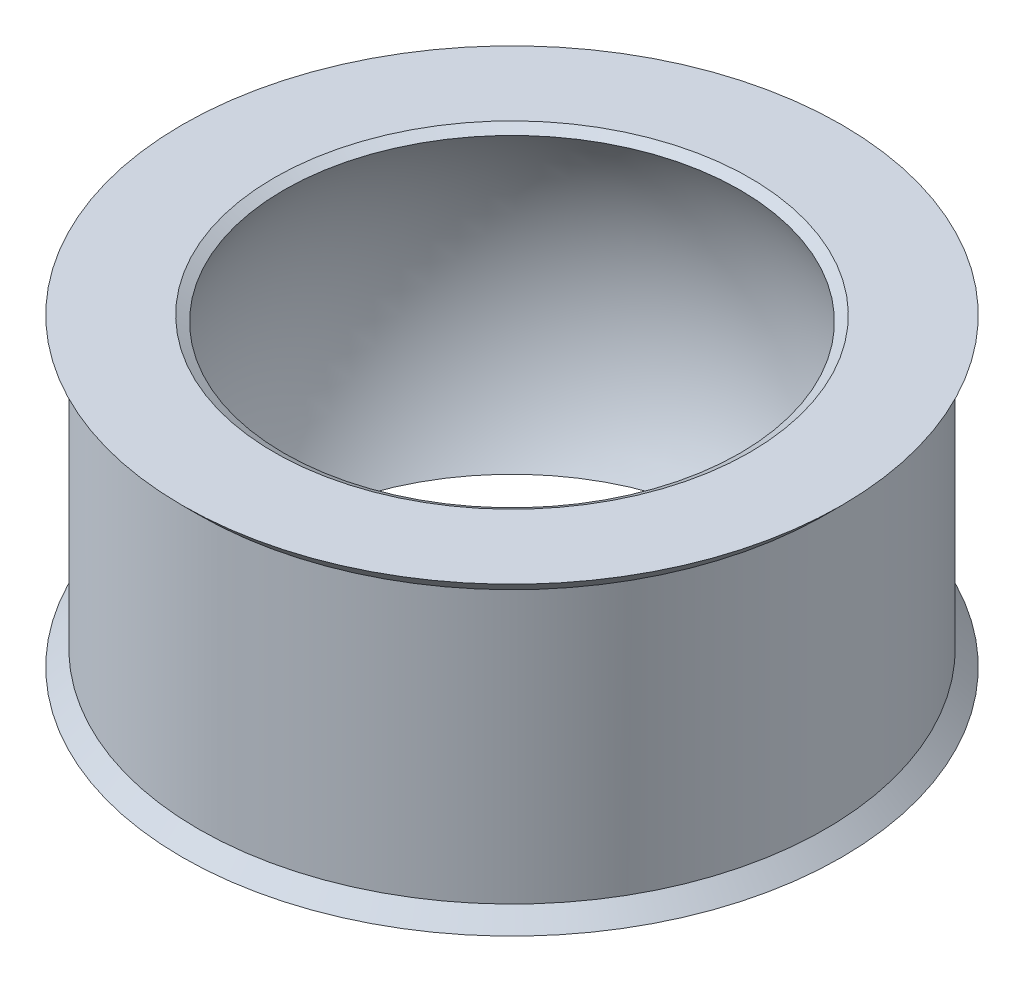
ISO-10303-21;
HEADER;
FILE_DESCRIPTION(('STEP AP214'),'2;1');
FILE_NAME('part.step','',(''),(''),'','','');
FILE_SCHEMA(('AUTOMOTIVE_DESIGN { 1 0 10303 214 1 1 1 1 }'));
ENDSEC;
DATA;
#1=APPLICATION_CONTEXT('core data for automotive mechanical design processes');
#2=APPLICATION_PROTOCOL_DEFINITION('international standard','automotive_design',2000,#1);
#3=PRODUCT_CONTEXT('',#1,'mechanical');
#4=PRODUCT('Part','Part','',(#3));
#5=PRODUCT_RELATED_PRODUCT_CATEGORY('part','',(#4));
#6=PRODUCT_DEFINITION_FORMATION('','',#4);
#7=PRODUCT_DEFINITION_CONTEXT('part definition',#1,'design');
#8=PRODUCT_DEFINITION('design','',#6,#7);
#9=PRODUCT_DEFINITION_SHAPE('','',#8);
#10=(LENGTH_UNIT() NAMED_UNIT(*) SI_UNIT(.MILLI.,.METRE.));
#11=(NAMED_UNIT(*) PLANE_ANGLE_UNIT() SI_UNIT($,.RADIAN.));
#12=(NAMED_UNIT(*) SI_UNIT($,.STERADIAN.) SOLID_ANGLE_UNIT());
#13=UNCERTAINTY_MEASURE_WITH_UNIT(LENGTH_MEASURE(1.E-05),#10,'distance_accuracy_value','');
#14=(GEOMETRIC_REPRESENTATION_CONTEXT(3) GLOBAL_UNCERTAINTY_ASSIGNED_CONTEXT((#13)) GLOBAL_UNIT_ASSIGNED_CONTEXT((#10,
#11,#12)) REPRESENTATION_CONTEXT('',''));
#15=CARTESIAN_POINT('',(0.,0.,0.));
#16=DIRECTION('',(0.,0.,1.));
#17=DIRECTION('',(1.,0.,0.));
#18=AXIS2_PLACEMENT_3D('',#15,#16,#17);
#19=CARTESIAN_POINT('',(0.,0.,39.6748));
#20=DIRECTION('',(0.,-1.,0.));
#21=DIRECTION('',(0.,0.,-1.));
#22=AXIS2_PLACEMENT_3D('',#19,#20,#21);
#23=DEGENERATE_TOROIDAL_SURFACE('',#22,0.00761999999998673,6.34369865976809,.T.);
#24=CARTESIAN_POINT('',(0.,-3.43613254301545,39.6748));
#25=DIRECTION('',(0.,-1.,0.));
#26=DIRECTION('',(1.,0.,0.));
#27=AXIS2_PLACEMENT_3D('',#24,#25,#26);
#28=CIRCLE('',#27,5.34011527264511);
#29=CARTESIAN_POINT('',(5.34011527264511,-3.43613254301545,39.6748));
#30=VERTEX_POINT('',#29);
#31=EDGE_CURVE('E32',#30,#30,#28,.T.);
#32=ORIENTED_EDGE('',*,*,#31,.T.);
#33=EDGE_LOOP('',(#32));
#34=FACE_BOUND('',#33,.T.);
#35=CARTESIAN_POINT('',(0.,3.43613254301545,39.6748));
#36=DIRECTION('',(0.,1.,0.));
#37=DIRECTION('',(1.,0.,0.));
#38=AXIS2_PLACEMENT_3D('',#35,#36,#37);
#39=CIRCLE('',#38,5.34011527258826);
#40=CARTESIAN_POINT('',(5.34011527258826,3.43613254301545,39.6748));
#41=VERTEX_POINT('',#40);
#42=EDGE_CURVE('E29',#41,#41,#39,.T.);
#43=ORIENTED_EDGE('',*,*,#42,.T.);
#44=EDGE_LOOP('',(#43));
#45=FACE_BOUND('',#44,.T.);
#46=ADVANCED_FACE('F14',(#34,#45),#23,.F.);
#47=CARTESIAN_POINT('',(0.,-3.56869999995979,39.6748));
#48=DIRECTION('',(0.,-1.,0.));
#49=DIRECTION('',(1.,0.,0.));
#50=AXIS2_PLACEMENT_3D('',#47,#48,#49);
#51=CONICAL_SURFACE('',#50,5.56982142103379,1.047372084121);
#52=ORIENTED_EDGE('',*,*,#31,.F.);
#53=EDGE_LOOP('',(#52));
#54=FACE_BOUND('',#53,.T.);
#55=CARTESIAN_POINT('',(0.,-3.56869999995979,39.6748));
#56=DIRECTION('',(0.,-1.,0.));
#57=DIRECTION('',(1.,0.,0.));
#58=AXIS2_PLACEMENT_3D('',#55,#56,#57);
#59=CIRCLE('',#58,5.56982142103379);
#60=CARTESIAN_POINT('',(5.56982142103379,-3.56869999995979,39.6748));
#61=VERTEX_POINT('',#60);
#62=EDGE_CURVE('E17',#61,#61,#59,.F.);
#63=ORIENTED_EDGE('',*,*,#62,.F.);
#64=EDGE_LOOP('',(#63));
#65=FACE_BOUND('',#64,.T.);
#66=ADVANCED_FACE('F48',(#54,#65),#51,.F.);
#67=CARTESIAN_POINT('',(0.,3.56869999995979,39.6748));
#68=DIRECTION('',(0.,1.,0.));
#69=DIRECTION('',(-1.,0.,0.));
#70=AXIS2_PLACEMENT_3D('',#67,#68,#69);
#71=CONICAL_SURFACE('',#70,5.56982142103379,1.04737208422814);
#72=CARTESIAN_POINT('',(0.,3.56869999995979,39.6748));
#73=DIRECTION('',(0.,1.,0.));
#74=DIRECTION('',(-1.,0.,0.));
#75=AXIS2_PLACEMENT_3D('',#72,#73,#74);
#76=CIRCLE('',#75,5.56982142103379);
#77=CARTESIAN_POINT('',(-5.56982142103379,3.56869999995979,39.6748));
#78=VERTEX_POINT('',#77);
#79=EDGE_CURVE('E39',#78,#78,#76,.F.);
#80=ORIENTED_EDGE('',*,*,#79,.F.);
#81=EDGE_LOOP('',(#80));
#82=FACE_BOUND('',#81,.T.);
#83=ORIENTED_EDGE('',*,*,#42,.F.);
#84=EDGE_LOOP('',(#83));
#85=FACE_BOUND('',#84,.T.);
#86=ADVANCED_FACE('F50',(#82,#85),#71,.F.);
#87=CARTESIAN_POINT('',(0.,-3.5687,39.6748));
#88=DIRECTION('',(0.,-1.,0.));
#89=DIRECTION('',(0.,0.,-1.));
#90=AXIS2_PLACEMENT_3D('',#87,#88,#89);
#91=PLANE('',#90);
#92=CARTESIAN_POINT('',(0.,-3.5687,39.6748));
#93=DIRECTION('',(0.,-1.,0.));
#94=DIRECTION('',(0.,0.,-1.));
#95=AXIS2_PLACEMENT_3D('',#92,#93,#94);
#96=CIRCLE('',#95,7.7216);
#97=CARTESIAN_POINT('',(0.,-3.5687,31.9532));
#98=VERTEX_POINT('',#97);
#99=EDGE_CURVE('E37',#98,#98,#96,.F.);
#100=ORIENTED_EDGE('',*,*,#99,.F.);
#101=EDGE_LOOP('',(#100));
#102=FACE_BOUND('',#101,.T.);
#103=ORIENTED_EDGE('',*,*,#62,.T.);
#104=EDGE_LOOP('',(#103));
#105=FACE_BOUND('',#104,.T.);
#106=ADVANCED_FACE('F46',(#102,#105),#91,.T.);
#107=CARTESIAN_POINT('',(0.,3.5687,39.6748));
#108=DIRECTION('',(0.,1.,0.));
#109=DIRECTION('',(0.,0.,1.));
#110=AXIS2_PLACEMENT_3D('',#107,#108,#109);
#111=PLANE('',#110);
#112=CARTESIAN_POINT('',(0.,3.5687,39.6748));
#113=DIRECTION('',(0.,1.,0.));
#114=DIRECTION('',(0.,0.,1.));
#115=AXIS2_PLACEMENT_3D('',#112,#113,#114);
#116=CIRCLE('',#115,7.7216);
#117=CARTESIAN_POINT('',(0.,3.5687,47.3964));
#118=VERTEX_POINT('',#117);
#119=EDGE_CURVE('E26',#118,#118,#116,.F.);
#120=ORIENTED_EDGE('',*,*,#119,.F.);
#121=EDGE_LOOP('',(#120));
#122=FACE_BOUND('',#121,.T.);
#123=ORIENTED_EDGE('',*,*,#79,.T.);
#124=EDGE_LOOP('',(#123));
#125=FACE_BOUND('',#124,.T.);
#126=ADVANCED_FACE('F75',(#122,#125),#111,.T.);
#127=CARTESIAN_POINT('',(0.,-3.5687,39.6748));
#128=DIRECTION('',(0.,-1.,0.));
#129=DIRECTION('',(0.,0.,-1.));
#130=AXIS2_PLACEMENT_3D('',#127,#128,#129);
#131=CONICAL_SURFACE('',#130,7.7216,0.785398163397448);
#132=CARTESIAN_POINT('',(0.,-3.1877,39.6748));
#133=DIRECTION('',(0.,1.,0.));
#134=DIRECTION('',(0.,0.,1.));
#135=AXIS2_PLACEMENT_3D('',#132,#133,#134);
#136=CIRCLE('',#135,7.3406);
#137=CARTESIAN_POINT('',(0.,-3.1877,47.0154));
#138=VERTEX_POINT('',#137);
#139=EDGE_CURVE('E21',#138,#138,#136,.T.);
#140=ORIENTED_EDGE('',*,*,#139,.F.);
#141=EDGE_LOOP('',(#140));
#142=FACE_BOUND('',#141,.T.);
#143=ORIENTED_EDGE('',*,*,#99,.T.);
#144=EDGE_LOOP('',(#143));
#145=FACE_BOUND('',#144,.T.);
#146=ADVANCED_FACE('F69',(#142,#145),#131,.T.);
#147=CARTESIAN_POINT('',(0.,3.5687,39.6748));
#148=DIRECTION('',(0.,1.,0.));
#149=DIRECTION('',(0.,0.,1.));
#150=AXIS2_PLACEMENT_3D('',#147,#148,#149);
#151=CONICAL_SURFACE('',#150,7.7216,0.785398163397451);
#152=ORIENTED_EDGE('',*,*,#119,.T.);
#153=EDGE_LOOP('',(#152));
#154=FACE_BOUND('',#153,.T.);
#155=CARTESIAN_POINT('',(0.,3.1877,39.6748));
#156=DIRECTION('',(0.,1.,0.));
#157=DIRECTION('',(0.,0.,1.));
#158=AXIS2_PLACEMENT_3D('',#155,#156,#157);
#159=CIRCLE('',#158,7.3406);
#160=CARTESIAN_POINT('',(0.,3.1877,47.0154));
#161=VERTEX_POINT('',#160);
#162=EDGE_CURVE('E9',#161,#161,#159,.F.);
#163=ORIENTED_EDGE('',*,*,#162,.F.);
#164=EDGE_LOOP('',(#163));
#165=FACE_BOUND('',#164,.T.);
#166=ADVANCED_FACE('F63',(#154,#165),#151,.T.);
#167=CARTESIAN_POINT('',(0.,0.,39.6748));
#168=DIRECTION('',(0.,1.,0.));
#169=DIRECTION('',(0.,0.,1.));
#170=AXIS2_PLACEMENT_3D('',#167,#168,#169);
#171=CYLINDRICAL_SURFACE('',#170,7.3406);
#172=ORIENTED_EDGE('',*,*,#139,.T.);
#173=EDGE_LOOP('',(#172));
#174=FACE_BOUND('',#173,.T.);
#175=ORIENTED_EDGE('',*,*,#162,.T.);
#176=EDGE_LOOP('',(#175));
#177=FACE_BOUND('',#176,.T.);
#178=ADVANCED_FACE('F61',(#174,#177),#171,.T.);
#179=CLOSED_SHELL('',(#46,#66,#86,#106,#126,#146,#166,#178));
#180=MANIFOLD_SOLID_BREP('B1',#179);
#181=ADVANCED_BREP_SHAPE_REPRESENTATION('',(#18,#180),#14);
#182=SHAPE_DEFINITION_REPRESENTATION(#9,#181);
ENDSEC;
END-ISO-10303-21;
